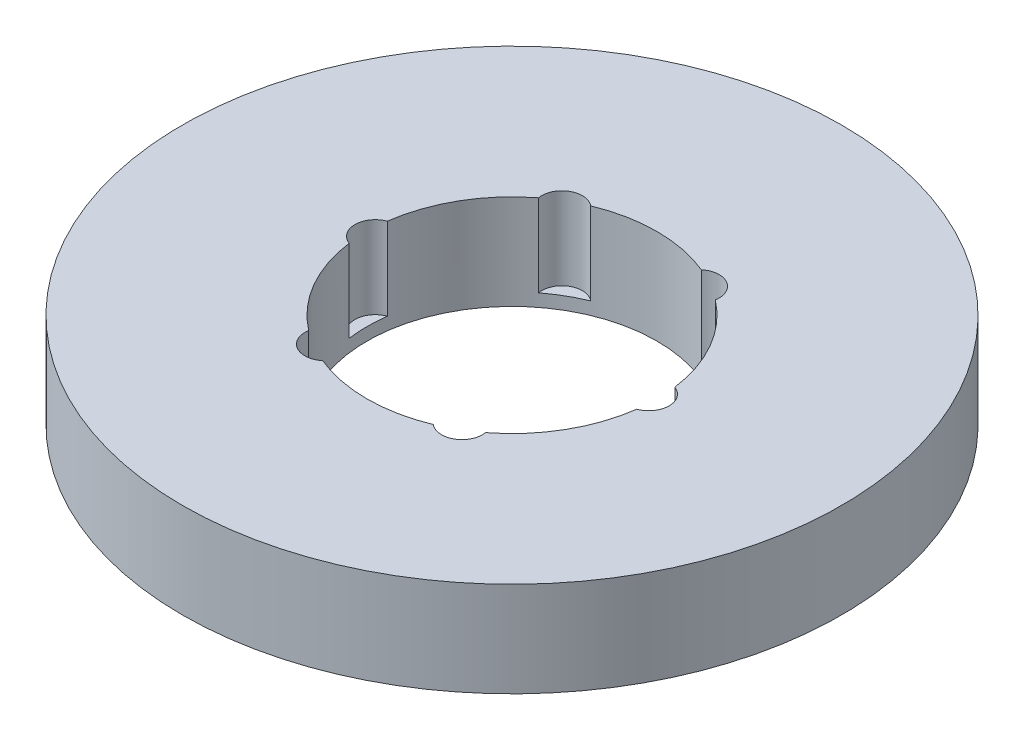
ISO-10303-21;
HEADER;
FILE_DESCRIPTION(('STEP AP214'),'2;1');
FILE_NAME('part.step','',(''),(''),'','','');
FILE_SCHEMA(('AUTOMOTIVE_DESIGN { 1 0 10303 214 1 1 1 1 }'));
ENDSEC;
DATA;
#1=APPLICATION_CONTEXT('core data for automotive mechanical design processes');
#2=APPLICATION_PROTOCOL_DEFINITION('international standard','automotive_design',2000,#1);
#3=PRODUCT_CONTEXT('',#1,'mechanical');
#4=PRODUCT('Part','Part','',(#3));
#5=PRODUCT_RELATED_PRODUCT_CATEGORY('part','',(#4));
#6=PRODUCT_DEFINITION_FORMATION('','',#4);
#7=PRODUCT_DEFINITION_CONTEXT('part definition',#1,'design');
#8=PRODUCT_DEFINITION('design','',#6,#7);
#9=PRODUCT_DEFINITION_SHAPE('','',#8);
#10=(LENGTH_UNIT() NAMED_UNIT(*) SI_UNIT(.MILLI.,.METRE.));
#11=(NAMED_UNIT(*) PLANE_ANGLE_UNIT() SI_UNIT($,.RADIAN.));
#12=(NAMED_UNIT(*) SI_UNIT($,.STERADIAN.) SOLID_ANGLE_UNIT());
#13=UNCERTAINTY_MEASURE_WITH_UNIT(LENGTH_MEASURE(1.E-05),#10,'distance_accuracy_value','');
#14=(GEOMETRIC_REPRESENTATION_CONTEXT(3) GLOBAL_UNCERTAINTY_ASSIGNED_CONTEXT((#13)) GLOBAL_UNIT_ASSIGNED_CONTEXT((#10,
#11,#12)) REPRESENTATION_CONTEXT('',''));
#15=CARTESIAN_POINT('',(0.,0.,0.));
#16=DIRECTION('',(0.,0.,1.));
#17=DIRECTION('',(1.,0.,0.));
#18=AXIS2_PLACEMENT_3D('',#15,#16,#17);
#19=CARTESIAN_POINT('',(0.,18.,0.));
#20=DIRECTION('',(0.,-1.,0.));
#21=DIRECTION('',(0.,0.,-1.));
#22=AXIS2_PLACEMENT_3D('',#19,#20,#21);
#23=CYLINDRICAL_SURFACE('',#22,62.5);
#24=CARTESIAN_POINT('',(0.,18.,0.));
#25=DIRECTION('',(0.,1.,0.));
#26=DIRECTION('',(0.,0.,1.));
#27=AXIS2_PLACEMENT_3D('',#24,#25,#26);
#28=CIRCLE('',#27,62.5);
#29=CARTESIAN_POINT('',(0.,18.,62.5));
#30=VERTEX_POINT('',#29);
#31=EDGE_CURVE('E162',#30,#30,#28,.T.);
#32=ORIENTED_EDGE('',*,*,#31,.F.);
#33=EDGE_LOOP('',(#32));
#34=FACE_BOUND('',#33,.T.);
#35=CARTESIAN_POINT('',(0.,0.,0.));
#36=DIRECTION('',(0.,1.,0.));
#37=DIRECTION('',(0.,0.,1.));
#38=AXIS2_PLACEMENT_3D('',#35,#36,#37);
#39=CIRCLE('',#38,62.5);
#40=CARTESIAN_POINT('',(0.,0.,62.5));
#41=VERTEX_POINT('',#40);
#42=EDGE_CURVE('E157',#41,#41,#39,.T.);
#43=ORIENTED_EDGE('',*,*,#42,.T.);
#44=EDGE_LOOP('',(#43));
#45=FACE_BOUND('',#44,.T.);
#46=ADVANCED_FACE('F39',(#34,#45),#23,.T.);
#47=CARTESIAN_POINT('',(0.,18.,0.));
#48=DIRECTION('',(0.,1.,0.));
#49=DIRECTION('',(0.,0.,1.));
#50=AXIS2_PLACEMENT_3D('',#47,#48,#49);
#51=PLANE('',#50);
#52=CARTESIAN_POINT('',(-12.9649899982475,18.,-22.4560213965864));
#53=DIRECTION('',(0.,1.,0.));
#54=DIRECTION('',(-0.866025403784433,0.,0.50000000000001));
#55=AXIS2_PLACEMENT_3D('',#52,#53,#54);
#56=CIRCLE('',#55,3.8594408126101);
#57=CARTESIAN_POINT('',(-10.4926193794307,18.,-25.4195778595632));
#58=VERTEX_POINT('',#57);
#59=CARTESIAN_POINT('',(-16.7676904901434,18.,-21.7966638646091));
#60=VERTEX_POINT('',#59);
#61=EDGE_CURVE('E218',#58,#60,#56,.T.);
#62=ORIENTED_EDGE('',*,*,#61,.F.);
#63=CARTESIAN_POINT('',(0.,18.,0.));
#64=DIRECTION('',(0.,1.,0.));
#65=DIRECTION('',(0.,0.,1.));
#66=AXIS2_PLACEMENT_3D('',#63,#64,#65);
#67=CIRCLE('',#66,27.5);
#68=CARTESIAN_POINT('',(10.4926193794301,18.,-25.4195778595634));
#69=VERTEX_POINT('',#68);
#70=EDGE_CURVE('E169',#69,#58,#67,.T.);
#71=ORIENTED_EDGE('',*,*,#70,.F.);
#72=CARTESIAN_POINT('',(12.964989998247,18.,-22.4560213965866));
#73=DIRECTION('',(0.,1.,0.));
#74=DIRECTION('',(-0.866025403784443,0.,-0.499999999999992));
#75=AXIS2_PLACEMENT_3D('',#72,#73,#74);
#76=CIRCLE('',#75,3.8594408126101);
#77=CARTESIAN_POINT('',(16.7676904901429,18.,-21.7966638646094));
#78=VERTEX_POINT('',#77);
#79=EDGE_CURVE('E285',#78,#69,#76,.T.);
#80=ORIENTED_EDGE('',*,*,#79,.F.);
#81=CARTESIAN_POINT('',(27.2603098695735,18.,-3.62291399495405));
#82=VERTEX_POINT('',#81);
#83=EDGE_CURVE('E174',#82,#78,#67,.T.);
#84=ORIENTED_EDGE('',*,*,#83,.F.);
#85=CARTESIAN_POINT('',(25.9299799964944,18.,0.));
#86=DIRECTION('',(0.,1.,0.));
#87=DIRECTION('',(0.,0.,-1.));
#88=AXIS2_PLACEMENT_3D('',#85,#86,#87);
#89=CIRCLE('',#88,3.8594408126101);
#90=CARTESIAN_POINT('',(27.2603098695735,18.,3.62291399495405));
#91=VERTEX_POINT('',#90);
#92=EDGE_CURVE('E280',#91,#82,#89,.T.);
#93=ORIENTED_EDGE('',*,*,#92,.F.);
#94=CARTESIAN_POINT('',(16.7676904901432,18.,21.7966638646092));
#95=VERTEX_POINT('',#94);
#96=EDGE_CURVE('E164',#95,#91,#67,.T.);
#97=ORIENTED_EDGE('',*,*,#96,.F.);
#98=CARTESIAN_POINT('',(12.9649899982473,18.,22.4560213965865));
#99=DIRECTION('',(0.,1.,0.));
#100=DIRECTION('',(0.866025403784436,0.,-0.500000000000004));
#101=AXIS2_PLACEMENT_3D('',#98,#99,#100);
#102=CIRCLE('',#101,3.8594408126101);
#103=CARTESIAN_POINT('',(10.4926193794305,18.,25.4195778595633));
#104=VERTEX_POINT('',#103);
#105=EDGE_CURVE('E269',#104,#95,#102,.T.);
#106=ORIENTED_EDGE('',*,*,#105,.F.);
#107=CARTESIAN_POINT('',(-10.4926193794303,18.,25.4195778595634));
#108=VERTEX_POINT('',#107);
#109=EDGE_CURVE('E149',#108,#104,#67,.T.);
#110=ORIENTED_EDGE('',*,*,#109,.F.);
#111=CARTESIAN_POINT('',(-12.9649899982472,18.,22.4560213965865));
#112=DIRECTION('',(0.,1.,0.));
#113=DIRECTION('',(0.86602540378444,0.,0.499999999999998));
#114=AXIS2_PLACEMENT_3D('',#111,#112,#113);
#115=CIRCLE('',#114,3.8594408126101);
#116=CARTESIAN_POINT('',(-16.7676904901431,18.,21.7966638646093));
#117=VERTEX_POINT('',#116);
#118=EDGE_CURVE('E128',#117,#108,#115,.T.);
#119=ORIENTED_EDGE('',*,*,#118,.F.);
#120=CARTESIAN_POINT('',(-27.2603098695735,18.,3.62291399495405));
#121=VERTEX_POINT('',#120);
#122=EDGE_CURVE('E148',#121,#117,#67,.T.);
#123=ORIENTED_EDGE('',*,*,#122,.F.);
#124=CARTESIAN_POINT('',(-25.9299799964944,18.,0.));
#125=DIRECTION('',(0.,1.,0.));
#126=DIRECTION('',(0.,0.,1.));
#127=AXIS2_PLACEMENT_3D('',#124,#125,#126);
#128=CIRCLE('',#127,3.8594408126101);
#129=CARTESIAN_POINT('',(-27.2603098695735,18.,-3.62291399495405));
#130=VERTEX_POINT('',#129);
#131=EDGE_CURVE('E179',#130,#121,#128,.T.);
#132=ORIENTED_EDGE('',*,*,#131,.F.);
#133=EDGE_CURVE('E161',#60,#130,#67,.T.);
#134=ORIENTED_EDGE('',*,*,#133,.F.);
#135=EDGE_LOOP('',(#62,#71,#80,#84,#93,#97,#106,#110,#119,#123,#132,#134));
#136=FACE_BOUND('',#135,.T.);
#137=ORIENTED_EDGE('',*,*,#31,.T.);
#138=EDGE_LOOP('',(#137));
#139=FACE_BOUND('',#138,.T.);
#140=ADVANCED_FACE('F141',(#136,#139),#51,.T.);
#141=CARTESIAN_POINT('',(0.,0.,0.));
#142=DIRECTION('',(0.,1.,0.));
#143=DIRECTION('',(0.,0.,1.));
#144=AXIS2_PLACEMENT_3D('',#141,#142,#143);
#145=PLANE('',#144);
#146=CARTESIAN_POINT('',(0.,0.,0.));
#147=DIRECTION('',(0.,1.,0.));
#148=DIRECTION('',(0.,0.,1.));
#149=AXIS2_PLACEMENT_3D('',#146,#147,#148);
#150=CIRCLE('',#149,27.5);
#151=CARTESIAN_POINT('',(0.,0.,27.5));
#152=VERTEX_POINT('',#151);
#153=EDGE_CURVE('E166',#152,#152,#150,.T.);
#154=ORIENTED_EDGE('',*,*,#153,.T.);
#155=EDGE_LOOP('',(#154));
#156=FACE_BOUND('',#155,.T.);
#157=ORIENTED_EDGE('',*,*,#42,.F.);
#158=EDGE_LOOP('',(#157));
#159=FACE_BOUND('',#158,.T.);
#160=ADVANCED_FACE('F234',(#156,#159),#145,.F.);
#161=CARTESIAN_POINT('',(0.,18.,0.));
#162=DIRECTION('',(0.,-1.,0.));
#163=DIRECTION('',(0.,0.,-1.));
#164=AXIS2_PLACEMENT_3D('',#161,#162,#163);
#165=CYLINDRICAL_SURFACE('',#164,27.5);
#166=DIRECTION('',(0.,1.,0.));
#167=VECTOR('',#166,1.);
#168=CARTESIAN_POINT('',(-10.4926193794307,10.1974969461113,-25.4195778595632));
#169=LINE('',#168,#167);
#170=CARTESIAN_POINT('',(-10.4926193794307,2.39499389222268,-25.4195778595632));
#171=VERTEX_POINT('',#170);
#172=EDGE_CURVE('E11',#171,#58,#169,.T.);
#173=ORIENTED_EDGE('',*,*,#172,.F.);
#174=CARTESIAN_POINT('',(0.,2.39499389222268,0.));
#175=DIRECTION('',(0.,1.,0.));
#176=DIRECTION('',(0.,0.,1.));
#177=AXIS2_PLACEMENT_3D('',#174,#175,#176);
#178=CIRCLE('',#177,27.5);
#179=CARTESIAN_POINT('',(-16.7676904901434,2.39499389222268,-21.7966638646091));
#180=VERTEX_POINT('',#179);
#181=EDGE_CURVE('E214',#171,#180,#178,.T.);
#182=ORIENTED_EDGE('',*,*,#181,.T.);
#183=DIRECTION('',(0.,1.,0.));
#184=VECTOR('',#183,1.);
#185=CARTESIAN_POINT('',(-16.7676904901434,10.1974969461113,-21.7966638646091));
#186=LINE('',#185,#184);
#187=EDGE_CURVE('E46',#60,#180,#186,.F.);
#188=ORIENTED_EDGE('',*,*,#187,.F.);
#189=ORIENTED_EDGE('',*,*,#133,.T.);
#190=DIRECTION('',(0.,1.,0.));
#191=VECTOR('',#190,1.);
#192=CARTESIAN_POINT('',(-27.2603098695735,10.1974969461113,-3.62291399495405));
#193=LINE('',#192,#191);
#194=CARTESIAN_POINT('',(-27.2603098695735,2.39499389222268,-3.62291399495405));
#195=VERTEX_POINT('',#194);
#196=EDGE_CURVE('E187',#195,#130,#193,.T.);
#197=ORIENTED_EDGE('',*,*,#196,.F.);
#198=CARTESIAN_POINT('',(0.,2.39499389222268,0.));
#199=DIRECTION('',(0.,1.,0.));
#200=DIRECTION('',(0.,0.,1.));
#201=AXIS2_PLACEMENT_3D('',#198,#199,#200);
#202=CIRCLE('',#201,27.5);
#203=CARTESIAN_POINT('',(-27.2603098695735,2.39499389222268,3.62291399495405));
#204=VERTEX_POINT('',#203);
#205=EDGE_CURVE('E184',#195,#204,#202,.T.);
#206=ORIENTED_EDGE('',*,*,#205,.T.);
#207=DIRECTION('',(0.,1.,0.));
#208=VECTOR('',#207,1.);
#209=CARTESIAN_POINT('',(-27.2603098695735,10.1974969461113,3.62291399495405));
#210=LINE('',#209,#208);
#211=EDGE_CURVE('E158',#121,#204,#210,.F.);
#212=ORIENTED_EDGE('',*,*,#211,.F.);
#213=ORIENTED_EDGE('',*,*,#122,.T.);
#214=DIRECTION('',(0.,1.,0.));
#215=VECTOR('',#214,1.);
#216=CARTESIAN_POINT('',(-16.7676904901431,10.1974969461113,21.7966638646093));
#217=LINE('',#216,#215);
#218=CARTESIAN_POINT('',(-16.7676904901431,2.39499389222268,21.7966638646093));
#219=VERTEX_POINT('',#218);
#220=EDGE_CURVE('E127',#219,#117,#217,.T.);
#221=ORIENTED_EDGE('',*,*,#220,.F.);
#222=CARTESIAN_POINT('',(0.,2.39499389222268,0.));
#223=DIRECTION('',(0.,1.,0.));
#224=DIRECTION('',(0.,0.,1.));
#225=AXIS2_PLACEMENT_3D('',#222,#223,#224);
#226=CIRCLE('',#225,27.5);
#227=CARTESIAN_POINT('',(-10.4926193794303,2.39499389222268,25.4195778595634));
#228=VERTEX_POINT('',#227);
#229=EDGE_CURVE('E189',#219,#228,#226,.T.);
#230=ORIENTED_EDGE('',*,*,#229,.T.);
#231=DIRECTION('',(0.,1.,0.));
#232=VECTOR('',#231,1.);
#233=CARTESIAN_POINT('',(-10.4926193794303,10.1974969461113,25.4195778595634));
#234=LINE('',#233,#232);
#235=EDGE_CURVE('E140',#108,#228,#234,.F.);
#236=ORIENTED_EDGE('',*,*,#235,.F.);
#237=ORIENTED_EDGE('',*,*,#109,.T.);
#238=DIRECTION('',(0.,1.,0.));
#239=VECTOR('',#238,1.);
#240=CARTESIAN_POINT('',(10.4926193794305,10.1974969461113,25.4195778595633));
#241=LINE('',#240,#239);
#242=CARTESIAN_POINT('',(10.4926193794305,2.39499389222268,25.4195778595633));
#243=VERTEX_POINT('',#242);
#244=EDGE_CURVE('E196',#243,#104,#241,.T.);
#245=ORIENTED_EDGE('',*,*,#244,.F.);
#246=CARTESIAN_POINT('',(0.,2.39499389222268,0.));
#247=DIRECTION('',(0.,1.,0.));
#248=DIRECTION('',(0.,0.,1.));
#249=AXIS2_PLACEMENT_3D('',#246,#247,#248);
#250=CIRCLE('',#249,27.5);
#251=CARTESIAN_POINT('',(16.7676904901432,2.39499389222268,21.7966638646092));
#252=VERTEX_POINT('',#251);
#253=EDGE_CURVE('E136',#243,#252,#250,.T.);
#254=ORIENTED_EDGE('',*,*,#253,.T.);
#255=DIRECTION('',(0.,1.,0.));
#256=VECTOR('',#255,1.);
#257=CARTESIAN_POINT('',(16.7676904901432,10.1974969461113,21.7966638646092));
#258=LINE('',#257,#256);
#259=EDGE_CURVE('E194',#95,#252,#258,.F.);
#260=ORIENTED_EDGE('',*,*,#259,.F.);
#261=ORIENTED_EDGE('',*,*,#96,.T.);
#262=DIRECTION('',(0.,1.,0.));
#263=VECTOR('',#262,1.);
#264=CARTESIAN_POINT('',(27.2603098695735,10.1974969461113,3.62291399495405));
#265=LINE('',#264,#263);
#266=CARTESIAN_POINT('',(27.2603098695735,2.39499389222268,3.62291399495405));
#267=VERTEX_POINT('',#266);
#268=EDGE_CURVE('E206',#267,#91,#265,.T.);
#269=ORIENTED_EDGE('',*,*,#268,.F.);
#270=CARTESIAN_POINT('',(0.,2.39499389222268,0.));
#271=DIRECTION('',(0.,1.,0.));
#272=DIRECTION('',(0.,0.,1.));
#273=AXIS2_PLACEMENT_3D('',#270,#271,#272);
#274=CIRCLE('',#273,27.5);
#275=CARTESIAN_POINT('',(27.2603098695735,2.39499389222268,-3.62291399495405));
#276=VERTEX_POINT('',#275);
#277=EDGE_CURVE('E199',#267,#276,#274,.T.);
#278=ORIENTED_EDGE('',*,*,#277,.T.);
#279=DIRECTION('',(0.,1.,0.));
#280=VECTOR('',#279,1.);
#281=CARTESIAN_POINT('',(27.2603098695735,10.1974969461113,-3.62291399495405));
#282=LINE('',#281,#280);
#283=EDGE_CURVE('E201',#82,#276,#282,.F.);
#284=ORIENTED_EDGE('',*,*,#283,.F.);
#285=ORIENTED_EDGE('',*,*,#83,.T.);
#286=DIRECTION('',(0.,1.,0.));
#287=VECTOR('',#286,1.);
#288=CARTESIAN_POINT('',(16.7676904901429,10.1974969461113,-21.7966638646094));
#289=LINE('',#288,#287);
#290=CARTESIAN_POINT('',(16.7676904901429,2.39499389222268,-21.7966638646094));
#291=VERTEX_POINT('',#290);
#292=EDGE_CURVE('E213',#291,#78,#289,.T.);
#293=ORIENTED_EDGE('',*,*,#292,.F.);
#294=CARTESIAN_POINT('',(0.,2.39499389222268,0.));
#295=DIRECTION('',(0.,1.,0.));
#296=DIRECTION('',(0.,0.,1.));
#297=AXIS2_PLACEMENT_3D('',#294,#295,#296);
#298=CIRCLE('',#297,27.5);
#299=CARTESIAN_POINT('',(10.4926193794301,2.39499389222268,-25.4195778595634));
#300=VERTEX_POINT('',#299);
#301=EDGE_CURVE('E208',#291,#300,#298,.T.);
#302=ORIENTED_EDGE('',*,*,#301,.T.);
#303=DIRECTION('',(0.,1.,0.));
#304=VECTOR('',#303,1.);
#305=CARTESIAN_POINT('',(10.4926193794301,10.1974969461113,-25.4195778595634));
#306=LINE('',#305,#304);
#307=EDGE_CURVE('E211',#69,#300,#306,.F.);
#308=ORIENTED_EDGE('',*,*,#307,.F.);
#309=ORIENTED_EDGE('',*,*,#70,.T.);
#310=EDGE_LOOP('',(#173,#182,#188,#189,#197,#206,#212,#213,#221,#230,#236,#237,#245,#254,#260,
#261,#269,#278,#284,#285,#293,#302,#308,#309));
#311=FACE_BOUND('',#310,.T.);
#312=ORIENTED_EDGE('',*,*,#153,.F.);
#313=EDGE_LOOP('',(#312));
#314=FACE_BOUND('',#313,.T.);
#315=ADVANCED_FACE('F152',(#311,#314),#165,.F.);
#316=CARTESIAN_POINT('',(-25.9299799964944,2.39499389222268,0.));
#317=DIRECTION('',(0.,1.,0.));
#318=DIRECTION('',(0.,0.,1.));
#319=AXIS2_PLACEMENT_3D('',#316,#317,#318);
#320=CYLINDRICAL_SURFACE('',#319,3.8594408126101);
#321=ORIENTED_EDGE('',*,*,#196,.T.);
#322=ORIENTED_EDGE('',*,*,#131,.T.);
#323=ORIENTED_EDGE('',*,*,#211,.T.);
#324=CARTESIAN_POINT('',(-25.9299799964944,2.39499389222268,0.));
#325=DIRECTION('',(0.,1.,0.));
#326=DIRECTION('',(0.,0.,1.));
#327=AXIS2_PLACEMENT_3D('',#324,#325,#326);
#328=CIRCLE('',#327,3.8594408126101);
#329=EDGE_CURVE('E180',#195,#204,#328,.T.);
#330=ORIENTED_EDGE('',*,*,#329,.F.);
#331=EDGE_LOOP('',(#321,#322,#323,#330));
#332=FACE_BOUND('',#331,.T.);
#333=ADVANCED_FACE('F244',(#332),#320,.F.);
#334=CARTESIAN_POINT('',(-25.9299799964944,2.39499389222268,0.));
#335=DIRECTION('',(0.,1.,0.));
#336=DIRECTION('',(0.,0.,1.));
#337=AXIS2_PLACEMENT_3D('',#334,#335,#336);
#338=PLANE('',#337);
#339=ORIENTED_EDGE('',*,*,#329,.T.);
#340=ORIENTED_EDGE('',*,*,#205,.F.);
#341=EDGE_LOOP('',(#339,#340));
#342=FACE_BOUND('',#341,.T.);
#343=ADVANCED_FACE('F248',(#342),#338,.T.);
#344=CARTESIAN_POINT('',(-12.9649899982472,2.39499389222268,22.4560213965865));
#345=DIRECTION('',(0.,1.,0.));
#346=DIRECTION('',(0.,0.,1.));
#347=AXIS2_PLACEMENT_3D('',#344,#345,#346);
#348=CYLINDRICAL_SURFACE('',#347,3.8594408126101);
#349=ORIENTED_EDGE('',*,*,#220,.T.);
#350=ORIENTED_EDGE('',*,*,#118,.T.);
#351=ORIENTED_EDGE('',*,*,#235,.T.);
#352=CARTESIAN_POINT('',(-12.9649899982472,2.39499389222268,22.4560213965865));
#353=DIRECTION('',(0.,1.,0.));
#354=DIRECTION('',(0.86602540378444,0.,0.499999999999998));
#355=AXIS2_PLACEMENT_3D('',#352,#353,#354);
#356=CIRCLE('',#355,3.8594408126101);
#357=EDGE_CURVE('E135',#219,#228,#356,.T.);
#358=ORIENTED_EDGE('',*,*,#357,.F.);
#359=EDGE_LOOP('',(#349,#350,#351,#358));
#360=FACE_BOUND('',#359,.T.);
#361=ADVANCED_FACE('F126',(#360),#348,.F.);
#362=CARTESIAN_POINT('',(-12.9649899982472,2.39499389222268,22.4560213965865));
#363=DIRECTION('',(0.,1.,0.));
#364=DIRECTION('',(0.86602540378444,0.,0.499999999999998));
#365=AXIS2_PLACEMENT_3D('',#362,#363,#364);
#366=PLANE('',#365);
#367=ORIENTED_EDGE('',*,*,#357,.T.);
#368=ORIENTED_EDGE('',*,*,#229,.F.);
#369=EDGE_LOOP('',(#367,#368));
#370=FACE_BOUND('',#369,.T.);
#371=ADVANCED_FACE('F258',(#370),#366,.T.);
#372=CARTESIAN_POINT('',(12.9649899982473,2.39499389222268,22.4560213965865));
#373=DIRECTION('',(0.,1.,0.));
#374=DIRECTION('',(0.,0.,1.));
#375=AXIS2_PLACEMENT_3D('',#372,#373,#374);
#376=CYLINDRICAL_SURFACE('',#375,3.8594408126101);
#377=ORIENTED_EDGE('',*,*,#244,.T.);
#378=ORIENTED_EDGE('',*,*,#105,.T.);
#379=ORIENTED_EDGE('',*,*,#259,.T.);
#380=CARTESIAN_POINT('',(12.9649899982473,2.39499389222268,22.4560213965865));
#381=DIRECTION('',(0.,1.,0.));
#382=DIRECTION('',(0.866025403784436,0.,-0.500000000000004));
#383=AXIS2_PLACEMENT_3D('',#380,#381,#382);
#384=CIRCLE('',#383,3.8594408126101);
#385=EDGE_CURVE('E147',#243,#252,#384,.T.);
#386=ORIENTED_EDGE('',*,*,#385,.F.);
#387=EDGE_LOOP('',(#377,#378,#379,#386));
#388=FACE_BOUND('',#387,.T.);
#389=ADVANCED_FACE('F256',(#388),#376,.F.);
#390=CARTESIAN_POINT('',(12.9649899982473,2.39499389222268,22.4560213965865));
#391=DIRECTION('',(0.,1.,0.));
#392=DIRECTION('',(0.866025403784436,0.,-0.500000000000004));
#393=AXIS2_PLACEMENT_3D('',#390,#391,#392);
#394=PLANE('',#393);
#395=ORIENTED_EDGE('',*,*,#385,.T.);
#396=ORIENTED_EDGE('',*,*,#253,.F.);
#397=EDGE_LOOP('',(#395,#396));
#398=FACE_BOUND('',#397,.T.);
#399=ADVANCED_FACE('F263',(#398),#394,.T.);
#400=CARTESIAN_POINT('',(25.9299799964944,2.39499389222268,0.));
#401=DIRECTION('',(0.,1.,0.));
#402=DIRECTION('',(0.,0.,1.));
#403=AXIS2_PLACEMENT_3D('',#400,#401,#402);
#404=CYLINDRICAL_SURFACE('',#403,3.8594408126101);
#405=ORIENTED_EDGE('',*,*,#268,.T.);
#406=ORIENTED_EDGE('',*,*,#92,.T.);
#407=ORIENTED_EDGE('',*,*,#283,.T.);
#408=CARTESIAN_POINT('',(25.9299799964944,2.39499389222268,0.));
#409=DIRECTION('',(0.,1.,0.));
#410=DIRECTION('',(0.,0.,-1.));
#411=AXIS2_PLACEMENT_3D('',#408,#409,#410);
#412=CIRCLE('',#411,3.8594408126101);
#413=EDGE_CURVE('E273',#267,#276,#412,.T.);
#414=ORIENTED_EDGE('',*,*,#413,.F.);
#415=EDGE_LOOP('',(#405,#406,#407,#414));
#416=FACE_BOUND('',#415,.T.);
#417=ADVANCED_FACE('F297',(#416),#404,.F.);
#418=CARTESIAN_POINT('',(25.9299799964944,2.39499389222268,0.));
#419=DIRECTION('',(0.,1.,0.));
#420=DIRECTION('',(0.,0.,-1.));
#421=AXIS2_PLACEMENT_3D('',#418,#419,#420);
#422=PLANE('',#421);
#423=ORIENTED_EDGE('',*,*,#413,.T.);
#424=ORIENTED_EDGE('',*,*,#277,.F.);
#425=EDGE_LOOP('',(#423,#424));
#426=FACE_BOUND('',#425,.T.);
#427=ADVANCED_FACE('F299',(#426),#422,.T.);
#428=CARTESIAN_POINT('',(12.964989998247,2.39499389222268,-22.4560213965866));
#429=DIRECTION('',(0.,1.,0.));
#430=DIRECTION('',(0.,0.,1.));
#431=AXIS2_PLACEMENT_3D('',#428,#429,#430);
#432=CYLINDRICAL_SURFACE('',#431,3.8594408126101);
#433=ORIENTED_EDGE('',*,*,#292,.T.);
#434=ORIENTED_EDGE('',*,*,#79,.T.);
#435=ORIENTED_EDGE('',*,*,#307,.T.);
#436=CARTESIAN_POINT('',(12.964989998247,2.39499389222268,-22.4560213965866));
#437=DIRECTION('',(0.,1.,0.));
#438=DIRECTION('',(-0.866025403784443,0.,-0.499999999999992));
#439=AXIS2_PLACEMENT_3D('',#436,#437,#438);
#440=CIRCLE('',#439,3.8594408126101);
#441=EDGE_CURVE('E56',#291,#300,#440,.T.);
#442=ORIENTED_EDGE('',*,*,#441,.F.);
#443=EDGE_LOOP('',(#433,#434,#435,#442));
#444=FACE_BOUND('',#443,.T.);
#445=ADVANCED_FACE('F292',(#444),#432,.F.);
#446=CARTESIAN_POINT('',(12.964989998247,2.39499389222268,-22.4560213965866));
#447=DIRECTION('',(0.,1.,0.));
#448=DIRECTION('',(-0.866025403784443,0.,-0.499999999999992));
#449=AXIS2_PLACEMENT_3D('',#446,#447,#448);
#450=PLANE('',#449);
#451=ORIENTED_EDGE('',*,*,#441,.T.);
#452=ORIENTED_EDGE('',*,*,#301,.F.);
#453=EDGE_LOOP('',(#451,#452));
#454=FACE_BOUND('',#453,.T.);
#455=ADVANCED_FACE('F226',(#454),#450,.T.);
#456=CARTESIAN_POINT('',(-12.9649899982475,2.39499389222268,-22.4560213965864));
#457=DIRECTION('',(0.,1.,0.));
#458=DIRECTION('',(0.,0.,1.));
#459=AXIS2_PLACEMENT_3D('',#456,#457,#458);
#460=CYLINDRICAL_SURFACE('',#459,3.8594408126101);
#461=ORIENTED_EDGE('',*,*,#172,.T.);
#462=ORIENTED_EDGE('',*,*,#61,.T.);
#463=ORIENTED_EDGE('',*,*,#187,.T.);
#464=CARTESIAN_POINT('',(-12.9649899982475,2.39499389222268,-22.4560213965864));
#465=DIRECTION('',(0.,1.,0.));
#466=DIRECTION('',(-0.866025403784433,0.,0.50000000000001));
#467=AXIS2_PLACEMENT_3D('',#464,#465,#466);
#468=CIRCLE('',#467,3.8594408126101);
#469=EDGE_CURVE('E55',#171,#180,#468,.T.);
#470=ORIENTED_EDGE('',*,*,#469,.F.);
#471=EDGE_LOOP('',(#461,#462,#463,#470));
#472=FACE_BOUND('',#471,.T.);
#473=ADVANCED_FACE('F217',(#472),#460,.F.);
#474=CARTESIAN_POINT('',(-12.9649899982475,2.39499389222268,-22.4560213965864));
#475=DIRECTION('',(0.,1.,0.));
#476=DIRECTION('',(-0.866025403784433,0.,0.50000000000001));
#477=AXIS2_PLACEMENT_3D('',#474,#475,#476);
#478=PLANE('',#477);
#479=ORIENTED_EDGE('',*,*,#469,.T.);
#480=ORIENTED_EDGE('',*,*,#181,.F.);
#481=EDGE_LOOP('',(#479,#480));
#482=FACE_BOUND('',#481,.T.);
#483=ADVANCED_FACE('F219',(#482),#478,.T.);
#484=CLOSED_SHELL('',(#46,#140,#160,#315,#333,#343,#361,#371,#389,#399,#417,#427,#445,#455,#473,#483));
#485=MANIFOLD_SOLID_BREP('B2',#484);
#486=ADVANCED_BREP_SHAPE_REPRESENTATION('',(#18,#485),#14);
#487=SHAPE_DEFINITION_REPRESENTATION(#9,#486);
ENDSEC;
END-ISO-10303-21;
